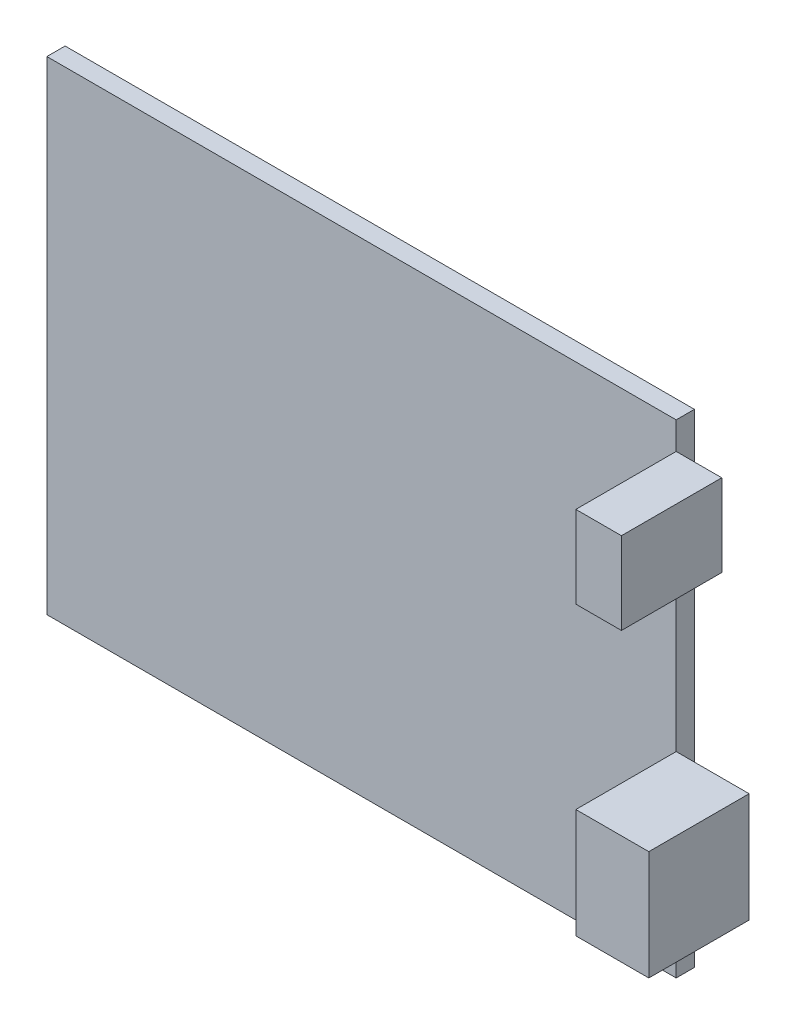
ISO-10303-21;
HEADER;
FILE_DESCRIPTION(('STEP AP214'),'2;1');
FILE_NAME('part.step','',(''),(''),'','','');
FILE_SCHEMA(('AUTOMOTIVE_DESIGN { 1 0 10303 214 1 1 1 1 }'));
ENDSEC;
DATA;
#1=APPLICATION_CONTEXT('core data for automotive mechanical design processes');
#2=APPLICATION_PROTOCOL_DEFINITION('international standard','automotive_design',2000,#1);
#3=PRODUCT_CONTEXT('',#1,'mechanical');
#4=PRODUCT('Part','Part','',(#3));
#5=PRODUCT_RELATED_PRODUCT_CATEGORY('part','',(#4));
#6=PRODUCT_DEFINITION_FORMATION('','',#4);
#7=PRODUCT_DEFINITION_CONTEXT('part definition',#1,'design');
#8=PRODUCT_DEFINITION('design','',#6,#7);
#9=PRODUCT_DEFINITION_SHAPE('','',#8);
#10=(LENGTH_UNIT() NAMED_UNIT(*) SI_UNIT(.MILLI.,.METRE.));
#11=(NAMED_UNIT(*) PLANE_ANGLE_UNIT() SI_UNIT($,.RADIAN.));
#12=(NAMED_UNIT(*) SI_UNIT($,.STERADIAN.) SOLID_ANGLE_UNIT());
#13=UNCERTAINTY_MEASURE_WITH_UNIT(LENGTH_MEASURE(1.E-05),#10,'distance_accuracy_value','');
#14=(GEOMETRIC_REPRESENTATION_CONTEXT(3) GLOBAL_UNCERTAINTY_ASSIGNED_CONTEXT((#13)) GLOBAL_UNIT_ASSIGNED_CONTEXT((#10,
#11,#12)) REPRESENTATION_CONTEXT('',''));
#15=CARTESIAN_POINT('',(0.,0.,0.));
#16=DIRECTION('',(0.,0.,1.));
#17=DIRECTION('',(1.,0.,0.));
#18=AXIS2_PLACEMENT_3D('',#15,#16,#17);
#19=CARTESIAN_POINT('',(74.,21.5,2.));
#20=DIRECTION('',(0.,0.,1.));
#21=DIRECTION('',(0.,-1.,0.));
#22=AXIS2_PLACEMENT_3D('',#19,#20,#21);
#23=PLANE('',#22);
#24=DIRECTION('',(0.,1.,0.));
#25=VECTOR('',#24,1.);
#26=CARTESIAN_POINT('',(69.,21.5,2.));
#27=LINE('',#26,#25);
#28=CARTESIAN_POINT('',(69.,9.49999999999999,2.));
#29=VERTEX_POINT('',#28);
#30=CARTESIAN_POINT('',(69.,21.5,2.));
#31=VERTEX_POINT('',#30);
#32=EDGE_CURVE('E110',#29,#31,#27,.T.);
#33=ORIENTED_EDGE('',*,*,#32,.T.);
#34=DIRECTION('',(-1.,0.,0.));
#35=VECTOR('',#34,1.);
#36=CARTESIAN_POINT('',(74.,21.5,2.));
#37=LINE('',#36,#35);
#38=CARTESIAN_POINT('',(77.,21.5,2.));
#39=VERTEX_POINT('',#38);
#40=EDGE_CURVE('E12',#39,#31,#37,.T.);
#41=ORIENTED_EDGE('',*,*,#40,.F.);
#42=DIRECTION('',(0.,1.,0.));
#43=VECTOR('',#42,1.);
#44=CARTESIAN_POINT('',(77.,9.49999999999999,2.));
#45=LINE('',#44,#43);
#46=CARTESIAN_POINT('',(77.,9.49999999999999,2.));
#47=VERTEX_POINT('',#46);
#48=EDGE_CURVE('E96',#47,#39,#45,.T.);
#49=ORIENTED_EDGE('',*,*,#48,.F.);
#50=DIRECTION('',(-1.,0.,0.));
#51=VECTOR('',#50,1.);
#52=CARTESIAN_POINT('',(74.,9.49999999999999,2.));
#53=LINE('',#52,#51);
#54=EDGE_CURVE('E85',#47,#29,#53,.T.);
#55=ORIENTED_EDGE('',*,*,#54,.T.);
#56=EDGE_LOOP('',(#33,#41,#49,#55));
#57=FACE_BOUND('',#56,.T.);
#58=ADVANCED_FACE('F46',(#57),#23,.F.);
#59=CARTESIAN_POINT('',(74.,21.5,2.));
#60=DIRECTION('',(0.,-1.,0.));
#61=DIRECTION('',(0.,0.,-1.));
#62=AXIS2_PLACEMENT_3D('',#59,#60,#61);
#63=PLANE('',#62);
#64=DIRECTION('',(0.,0.,1.));
#65=VECTOR('',#64,1.);
#66=CARTESIAN_POINT('',(69.,21.5,2.));
#67=LINE('',#66,#65);
#68=CARTESIAN_POINT('',(69.,21.5,13.));
#69=VERTEX_POINT('',#68);
#70=EDGE_CURVE('E112',#31,#69,#67,.T.);
#71=ORIENTED_EDGE('',*,*,#70,.T.);
#72=DIRECTION('',(-1.,0.,0.));
#73=VECTOR('',#72,1.);
#74=CARTESIAN_POINT('',(74.,21.5,13.));
#75=LINE('',#74,#73);
#76=CARTESIAN_POINT('',(77.,21.5,13.));
#77=VERTEX_POINT('',#76);
#78=EDGE_CURVE('E53',#77,#69,#75,.T.);
#79=ORIENTED_EDGE('',*,*,#78,.F.);
#80=DIRECTION('',(0.,0.,1.));
#81=VECTOR('',#80,1.);
#82=CARTESIAN_POINT('',(77.,21.5,2.));
#83=LINE('',#82,#81);
#84=EDGE_CURVE('E100',#39,#77,#83,.T.);
#85=ORIENTED_EDGE('',*,*,#84,.F.);
#86=ORIENTED_EDGE('',*,*,#40,.T.);
#87=EDGE_LOOP('',(#71,#79,#85,#86));
#88=FACE_BOUND('',#87,.T.);
#89=ADVANCED_FACE('F120',(#88),#63,.F.);
#90=CARTESIAN_POINT('',(74.,21.5,13.));
#91=DIRECTION('',(0.,0.,-1.));
#92=DIRECTION('',(-1.,0.,0.));
#93=AXIS2_PLACEMENT_3D('',#90,#91,#92);
#94=PLANE('',#93);
#95=DIRECTION('',(0.,-1.,0.));
#96=VECTOR('',#95,1.);
#97=CARTESIAN_POINT('',(69.,21.5,13.));
#98=LINE('',#97,#96);
#99=CARTESIAN_POINT('',(69.,9.49999999999999,13.));
#100=VERTEX_POINT('',#99);
#101=EDGE_CURVE('E68',#69,#100,#98,.T.);
#102=ORIENTED_EDGE('',*,*,#101,.T.);
#103=DIRECTION('',(-1.,0.,0.));
#104=VECTOR('',#103,1.);
#105=CARTESIAN_POINT('',(74.,9.49999999999999,13.));
#106=LINE('',#105,#104);
#107=CARTESIAN_POINT('',(77.,9.49999999999999,13.));
#108=VERTEX_POINT('',#107);
#109=EDGE_CURVE('E93',#108,#100,#106,.T.);
#110=ORIENTED_EDGE('',*,*,#109,.F.);
#111=DIRECTION('',(0.,-1.,0.));
#112=VECTOR('',#111,1.);
#113=CARTESIAN_POINT('',(77.,21.5,13.));
#114=LINE('',#113,#112);
#115=EDGE_CURVE('E105',#77,#108,#114,.T.);
#116=ORIENTED_EDGE('',*,*,#115,.F.);
#117=ORIENTED_EDGE('',*,*,#78,.T.);
#118=EDGE_LOOP('',(#102,#110,#116,#117));
#119=FACE_BOUND('',#118,.T.);
#120=ADVANCED_FACE('F116',(#119),#94,.F.);
#121=CARTESIAN_POINT('',(74.,9.49999999999999,2.));
#122=DIRECTION('',(0.,1.,0.));
#123=DIRECTION('',(0.,0.,1.));
#124=AXIS2_PLACEMENT_3D('',#121,#122,#123);
#125=PLANE('',#124);
#126=DIRECTION('',(0.,0.,-1.));
#127=VECTOR('',#126,1.);
#128=CARTESIAN_POINT('',(69.,9.49999999999999,2.));
#129=LINE('',#128,#127);
#130=EDGE_CURVE('E60',#100,#29,#129,.T.);
#131=ORIENTED_EDGE('',*,*,#130,.T.);
#132=ORIENTED_EDGE('',*,*,#54,.F.);
#133=DIRECTION('',(0.,0.,-1.));
#134=VECTOR('',#133,1.);
#135=CARTESIAN_POINT('',(77.,9.49999999999999,13.));
#136=LINE('',#135,#134);
#137=EDGE_CURVE('E89',#108,#47,#136,.T.);
#138=ORIENTED_EDGE('',*,*,#137,.F.);
#139=ORIENTED_EDGE('',*,*,#109,.T.);
#140=EDGE_LOOP('',(#131,#132,#138,#139));
#141=FACE_BOUND('',#140,.T.);
#142=ADVANCED_FACE('F87',(#141),#125,.F.);
#143=CARTESIAN_POINT('',(69.,0.,0.));
#144=DIRECTION('',(-1.,0.,0.));
#145=DIRECTION('',(0.,0.,1.));
#146=AXIS2_PLACEMENT_3D('',#143,#144,#145);
#147=PLANE('',#146);
#148=ORIENTED_EDGE('',*,*,#32,.F.);
#149=ORIENTED_EDGE('',*,*,#130,.F.);
#150=ORIENTED_EDGE('',*,*,#101,.F.);
#151=ORIENTED_EDGE('',*,*,#70,.F.);
#152=EDGE_LOOP('',(#148,#149,#150,#151));
#153=FACE_BOUND('',#152,.T.);
#154=ADVANCED_FACE('F119',(#153),#147,.T.);
#155=CARTESIAN_POINT('',(77.,0.,0.));
#156=DIRECTION('',(1.,0.,0.));
#157=DIRECTION('',(0.,0.,-1.));
#158=AXIS2_PLACEMENT_3D('',#155,#156,#157);
#159=PLANE('',#158);
#160=ORIENTED_EDGE('',*,*,#137,.T.);
#161=ORIENTED_EDGE('',*,*,#48,.T.);
#162=ORIENTED_EDGE('',*,*,#84,.T.);
#163=ORIENTED_EDGE('',*,*,#115,.T.);
#164=EDGE_LOOP('',(#160,#161,#162,#163));
#165=FACE_BOUND('',#164,.T.);
#166=ADVANCED_FACE('F103',(#165),#159,.T.);
#167=CLOSED_SHELL('',(#58,#89,#120,#142,#154,#166));
#168=MANIFOLD_SOLID_BREP('B2',#167);
#169=CARTESIAN_POINT('',(74.,50.,2.));
#170=DIRECTION('',(0.,0.,1.));
#171=DIRECTION('',(0.,-1.,0.));
#172=AXIS2_PLACEMENT_3D('',#169,#170,#171);
#173=PLANE('',#172);
#174=DIRECTION('',(0.,1.,0.));
#175=VECTOR('',#174,1.);
#176=CARTESIAN_POINT('',(69.,50.,2.));
#177=LINE('',#176,#175);
#178=CARTESIAN_POINT('',(69.,41.,2.));
#179=VERTEX_POINT('',#178);
#180=CARTESIAN_POINT('',(69.,50.,2.));
#181=VERTEX_POINT('',#180);
#182=EDGE_CURVE('E254',#179,#181,#177,.T.);
#183=ORIENTED_EDGE('',*,*,#182,.T.);
#184=DIRECTION('',(-1.,0.,0.));
#185=VECTOR('',#184,1.);
#186=CARTESIAN_POINT('',(74.,50.,2.));
#187=LINE('',#186,#185);
#188=CARTESIAN_POINT('',(74.,50.,2.));
#189=VERTEX_POINT('',#188);
#190=EDGE_CURVE('E44',#189,#181,#187,.T.);
#191=ORIENTED_EDGE('',*,*,#190,.F.);
#192=DIRECTION('',(0.,1.,0.));
#193=VECTOR('',#192,1.);
#194=CARTESIAN_POINT('',(74.,50.,2.));
#195=LINE('',#194,#193);
#196=CARTESIAN_POINT('',(74.,41.,2.));
#197=VERTEX_POINT('',#196);
#198=EDGE_CURVE('E242',#197,#189,#195,.T.);
#199=ORIENTED_EDGE('',*,*,#198,.F.);
#200=DIRECTION('',(-1.,0.,0.));
#201=VECTOR('',#200,1.);
#202=CARTESIAN_POINT('',(74.,41.,2.));
#203=LINE('',#202,#201);
#204=EDGE_CURVE('E250',#197,#179,#203,.T.);
#205=ORIENTED_EDGE('',*,*,#204,.T.);
#206=EDGE_LOOP('',(#183,#191,#199,#205));
#207=FACE_BOUND('',#206,.T.);
#208=ADVANCED_FACE('F191',(#207),#173,.F.);
#209=CARTESIAN_POINT('',(74.,50.,2.));
#210=DIRECTION('',(0.,-1.,0.));
#211=DIRECTION('',(0.,0.,-1.));
#212=AXIS2_PLACEMENT_3D('',#209,#210,#211);
#213=PLANE('',#212);
#214=DIRECTION('',(0.,0.,1.));
#215=VECTOR('',#214,1.);
#216=CARTESIAN_POINT('',(69.,50.,2.));
#217=LINE('',#216,#215);
#218=CARTESIAN_POINT('',(69.,50.,13.));
#219=VERTEX_POINT('',#218);
#220=EDGE_CURVE('E246',#181,#219,#217,.T.);
#221=ORIENTED_EDGE('',*,*,#220,.T.);
#222=DIRECTION('',(-1.,0.,0.));
#223=VECTOR('',#222,1.);
#224=CARTESIAN_POINT('',(74.,50.,13.));
#225=LINE('',#224,#223);
#226=CARTESIAN_POINT('',(74.,50.,13.));
#227=VERTEX_POINT('',#226);
#228=EDGE_CURVE('E199',#227,#219,#225,.T.);
#229=ORIENTED_EDGE('',*,*,#228,.F.);
#230=DIRECTION('',(0.,0.,1.));
#231=VECTOR('',#230,1.);
#232=CARTESIAN_POINT('',(74.,50.,2.));
#233=LINE('',#232,#231);
#234=EDGE_CURVE('E237',#189,#227,#233,.T.);
#235=ORIENTED_EDGE('',*,*,#234,.F.);
#236=ORIENTED_EDGE('',*,*,#190,.T.);
#237=EDGE_LOOP('',(#221,#229,#235,#236));
#238=FACE_BOUND('',#237,.T.);
#239=ADVANCED_FACE('F245',(#238),#213,.F.);
#240=CARTESIAN_POINT('',(74.,50.,13.));
#241=DIRECTION('',(0.,0.,-1.));
#242=DIRECTION('',(0.,1.,0.));
#243=AXIS2_PLACEMENT_3D('',#240,#241,#242);
#244=PLANE('',#243);
#245=DIRECTION('',(0.,-1.,0.));
#246=VECTOR('',#245,1.);
#247=CARTESIAN_POINT('',(69.,50.,13.));
#248=LINE('',#247,#246);
#249=CARTESIAN_POINT('',(69.,41.,13.));
#250=VERTEX_POINT('',#249);
#251=EDGE_CURVE('E224',#219,#250,#248,.T.);
#252=ORIENTED_EDGE('',*,*,#251,.T.);
#253=DIRECTION('',(-1.,0.,0.));
#254=VECTOR('',#253,1.);
#255=CARTESIAN_POINT('',(74.,41.,13.));
#256=LINE('',#255,#254);
#257=CARTESIAN_POINT('',(74.,41.,13.));
#258=VERTEX_POINT('',#257);
#259=EDGE_CURVE('E247',#258,#250,#256,.T.);
#260=ORIENTED_EDGE('',*,*,#259,.F.);
#261=DIRECTION('',(0.,-1.,0.));
#262=VECTOR('',#261,1.);
#263=CARTESIAN_POINT('',(74.,50.,13.));
#264=LINE('',#263,#262);
#265=EDGE_CURVE('E240',#227,#258,#264,.T.);
#266=ORIENTED_EDGE('',*,*,#265,.F.);
#267=ORIENTED_EDGE('',*,*,#228,.T.);
#268=EDGE_LOOP('',(#252,#260,#266,#267));
#269=FACE_BOUND('',#268,.T.);
#270=ADVANCED_FACE('F248',(#269),#244,.F.);
#271=CARTESIAN_POINT('',(74.,41.,2.));
#272=DIRECTION('',(0.,1.,0.));
#273=DIRECTION('',(0.,0.,1.));
#274=AXIS2_PLACEMENT_3D('',#271,#272,#273);
#275=PLANE('',#274);
#276=DIRECTION('',(0.,0.,-1.));
#277=VECTOR('',#276,1.);
#278=CARTESIAN_POINT('',(69.,41.,2.));
#279=LINE('',#278,#277);
#280=EDGE_CURVE('E230',#250,#179,#279,.T.);
#281=ORIENTED_EDGE('',*,*,#280,.T.);
#282=ORIENTED_EDGE('',*,*,#204,.F.);
#283=DIRECTION('',(0.,0.,-1.));
#284=VECTOR('',#283,1.);
#285=CARTESIAN_POINT('',(74.,41.,2.));
#286=LINE('',#285,#284);
#287=EDGE_CURVE('E207',#258,#197,#286,.T.);
#288=ORIENTED_EDGE('',*,*,#287,.F.);
#289=ORIENTED_EDGE('',*,*,#259,.T.);
#290=EDGE_LOOP('',(#281,#282,#288,#289));
#291=FACE_BOUND('',#290,.T.);
#292=ADVANCED_FACE('F261',(#291),#275,.F.);
#293=CARTESIAN_POINT('',(74.,0.,0.));
#294=DIRECTION('',(-1.,0.,0.));
#295=DIRECTION('',(0.,0.,1.));
#296=AXIS2_PLACEMENT_3D('',#293,#294,#295);
#297=PLANE('',#296);
#298=ORIENTED_EDGE('',*,*,#198,.T.);
#299=ORIENTED_EDGE('',*,*,#234,.T.);
#300=ORIENTED_EDGE('',*,*,#265,.T.);
#301=ORIENTED_EDGE('',*,*,#287,.T.);
#302=EDGE_LOOP('',(#298,#299,#300,#301));
#303=FACE_BOUND('',#302,.T.);
#304=ADVANCED_FACE('F238',(#303),#297,.F.);
#305=CARTESIAN_POINT('',(69.,0.,0.));
#306=DIRECTION('',(-1.,0.,0.));
#307=DIRECTION('',(0.,0.,1.));
#308=AXIS2_PLACEMENT_3D('',#305,#306,#307);
#309=PLANE('',#308);
#310=ORIENTED_EDGE('',*,*,#182,.F.);
#311=ORIENTED_EDGE('',*,*,#280,.F.);
#312=ORIENTED_EDGE('',*,*,#251,.F.);
#313=ORIENTED_EDGE('',*,*,#220,.F.);
#314=EDGE_LOOP('',(#310,#311,#312,#313));
#315=FACE_BOUND('',#314,.T.);
#316=ADVANCED_FACE('F264',(#315),#309,.T.);
#317=CLOSED_SHELL('',(#208,#239,#270,#292,#304,#316));
#318=MANIFOLD_SOLID_BREP('B6',#317);
#319=CARTESIAN_POINT('',(0.,0.,2.));
#320=DIRECTION('',(1.,0.,0.));
#321=DIRECTION('',(0.,0.,-1.));
#322=AXIS2_PLACEMENT_3D('',#319,#320,#321);
#323=PLANE('',#322);
#324=DIRECTION('',(0.,-1.,0.));
#325=VECTOR('',#324,1.);
#326=CARTESIAN_POINT('',(0.,0.,0.));
#327=LINE('',#326,#325);
#328=CARTESIAN_POINT('',(0.,53.,0.));
#329=VERTEX_POINT('',#328);
#330=CARTESIAN_POINT('',(0.,0.,0.));
#331=VERTEX_POINT('',#330);
#332=EDGE_CURVE('E378',#329,#331,#327,.T.);
#333=ORIENTED_EDGE('',*,*,#332,.T.);
#334=DIRECTION('',(0.,0.,-1.));
#335=VECTOR('',#334,1.);
#336=CARTESIAN_POINT('',(0.,0.,2.));
#337=LINE('',#336,#335);
#338=CARTESIAN_POINT('',(0.,0.,2.));
#339=VERTEX_POINT('',#338);
#340=EDGE_CURVE('E189',#339,#331,#337,.T.);
#341=ORIENTED_EDGE('',*,*,#340,.F.);
#342=DIRECTION('',(0.,-1.,0.));
#343=VECTOR('',#342,1.);
#344=CARTESIAN_POINT('',(0.,0.,2.));
#345=LINE('',#344,#343);
#346=CARTESIAN_POINT('',(0.,53.,2.));
#347=VERTEX_POINT('',#346);
#348=EDGE_CURVE('E366',#347,#339,#345,.T.);
#349=ORIENTED_EDGE('',*,*,#348,.F.);
#350=DIRECTION('',(0.,0.,-1.));
#351=VECTOR('',#350,1.);
#352=CARTESIAN_POINT('',(0.,53.,2.));
#353=LINE('',#352,#351);
#354=EDGE_CURVE('E374',#347,#329,#353,.T.);
#355=ORIENTED_EDGE('',*,*,#354,.T.);
#356=EDGE_LOOP('',(#333,#341,#349,#355));
#357=FACE_BOUND('',#356,.T.);
#358=ADVANCED_FACE('F315',(#357),#323,.F.);
#359=CARTESIAN_POINT('',(0.,0.,2.));
#360=DIRECTION('',(0.,1.,0.));
#361=DIRECTION('',(0.,0.,1.));
#362=AXIS2_PLACEMENT_3D('',#359,#360,#361);
#363=PLANE('',#362);
#364=DIRECTION('',(1.,0.,0.));
#365=VECTOR('',#364,1.);
#366=CARTESIAN_POINT('',(0.,0.,0.));
#367=LINE('',#366,#365);
#368=CARTESIAN_POINT('',(69.,0.,0.));
#369=VERTEX_POINT('',#368);
#370=EDGE_CURVE('E370',#331,#369,#367,.T.);
#371=ORIENTED_EDGE('',*,*,#370,.T.);
#372=DIRECTION('',(0.,0.,-1.));
#373=VECTOR('',#372,1.);
#374=CARTESIAN_POINT('',(69.,0.,2.));
#375=LINE('',#374,#373);
#376=CARTESIAN_POINT('',(69.,0.,2.));
#377=VERTEX_POINT('',#376);
#378=EDGE_CURVE('E323',#377,#369,#375,.T.);
#379=ORIENTED_EDGE('',*,*,#378,.F.);
#380=DIRECTION('',(1.,0.,0.));
#381=VECTOR('',#380,1.);
#382=CARTESIAN_POINT('',(0.,0.,2.));
#383=LINE('',#382,#381);
#384=EDGE_CURVE('E361',#339,#377,#383,.T.);
#385=ORIENTED_EDGE('',*,*,#384,.F.);
#386=ORIENTED_EDGE('',*,*,#340,.T.);
#387=EDGE_LOOP('',(#371,#379,#385,#386));
#388=FACE_BOUND('',#387,.T.);
#389=ADVANCED_FACE('F369',(#388),#363,.F.);
#390=CARTESIAN_POINT('',(69.,0.,2.));
#391=DIRECTION('',(-1.,0.,0.));
#392=DIRECTION('',(0.,0.,1.));
#393=AXIS2_PLACEMENT_3D('',#390,#391,#392);
#394=PLANE('',#393);
#395=DIRECTION('',(0.,1.,0.));
#396=VECTOR('',#395,1.);
#397=CARTESIAN_POINT('',(69.,0.,0.));
#398=LINE('',#397,#396);
#399=CARTESIAN_POINT('',(69.,53.,0.));
#400=VERTEX_POINT('',#399);
#401=EDGE_CURVE('E348',#369,#400,#398,.T.);
#402=ORIENTED_EDGE('',*,*,#401,.T.);
#403=DIRECTION('',(0.,0.,-1.));
#404=VECTOR('',#403,1.);
#405=CARTESIAN_POINT('',(69.,53.,2.));
#406=LINE('',#405,#404);
#407=CARTESIAN_POINT('',(69.,53.,2.));
#408=VERTEX_POINT('',#407);
#409=EDGE_CURVE('E371',#408,#400,#406,.T.);
#410=ORIENTED_EDGE('',*,*,#409,.F.);
#411=DIRECTION('',(0.,1.,0.));
#412=VECTOR('',#411,1.);
#413=CARTESIAN_POINT('',(69.,0.,2.));
#414=LINE('',#413,#412);
#415=EDGE_CURVE('E364',#377,#408,#414,.T.);
#416=ORIENTED_EDGE('',*,*,#415,.F.);
#417=ORIENTED_EDGE('',*,*,#378,.T.);
#418=EDGE_LOOP('',(#402,#410,#416,#417));
#419=FACE_BOUND('',#418,.T.);
#420=ADVANCED_FACE('F372',(#419),#394,.F.);
#421=CARTESIAN_POINT('',(0.,53.,2.));
#422=DIRECTION('',(0.,-1.,0.));
#423=DIRECTION('',(0.,0.,-1.));
#424=AXIS2_PLACEMENT_3D('',#421,#422,#423);
#425=PLANE('',#424);
#426=DIRECTION('',(-1.,0.,0.));
#427=VECTOR('',#426,1.);
#428=CARTESIAN_POINT('',(0.,53.,0.));
#429=LINE('',#428,#427);
#430=EDGE_CURVE('E354',#400,#329,#429,.T.);
#431=ORIENTED_EDGE('',*,*,#430,.T.);
#432=ORIENTED_EDGE('',*,*,#354,.F.);
#433=DIRECTION('',(-1.,0.,0.));
#434=VECTOR('',#433,1.);
#435=CARTESIAN_POINT('',(0.,53.,2.));
#436=LINE('',#435,#434);
#437=EDGE_CURVE('E331',#408,#347,#436,.T.);
#438=ORIENTED_EDGE('',*,*,#437,.F.);
#439=ORIENTED_EDGE('',*,*,#409,.T.);
#440=EDGE_LOOP('',(#431,#432,#438,#439));
#441=FACE_BOUND('',#440,.T.);
#442=ADVANCED_FACE('F385',(#441),#425,.F.);
#443=CARTESIAN_POINT('',(0.,0.,2.));
#444=DIRECTION('',(0.,0.,-1.));
#445=DIRECTION('',(-1.,0.,0.));
#446=AXIS2_PLACEMENT_3D('',#443,#444,#445);
#447=PLANE('',#446);
#448=ORIENTED_EDGE('',*,*,#348,.T.);
#449=ORIENTED_EDGE('',*,*,#384,.T.);
#450=ORIENTED_EDGE('',*,*,#415,.T.);
#451=ORIENTED_EDGE('',*,*,#437,.T.);
#452=EDGE_LOOP('',(#448,#449,#450,#451));
#453=FACE_BOUND('',#452,.T.);
#454=ADVANCED_FACE('F362',(#453),#447,.F.);
#455=CARTESIAN_POINT('',(0.,0.,0.));
#456=DIRECTION('',(0.,0.,-1.));
#457=DIRECTION('',(-1.,0.,0.));
#458=AXIS2_PLACEMENT_3D('',#455,#456,#457);
#459=PLANE('',#458);
#460=ORIENTED_EDGE('',*,*,#332,.F.);
#461=ORIENTED_EDGE('',*,*,#430,.F.);
#462=ORIENTED_EDGE('',*,*,#401,.F.);
#463=ORIENTED_EDGE('',*,*,#370,.F.);
#464=EDGE_LOOP('',(#460,#461,#462,#463));
#465=FACE_BOUND('',#464,.T.);
#466=ADVANCED_FACE('F388',(#465),#459,.T.);
#467=CLOSED_SHELL('',(#358,#389,#420,#442,#454,#466));
#468=MANIFOLD_SOLID_BREP('B38',#467);
#469=ADVANCED_BREP_SHAPE_REPRESENTATION('',(#18,#168,#318,#468),#14);
#470=SHAPE_DEFINITION_REPRESENTATION(#9,#469);
ENDSEC;
END-ISO-10303-21;
